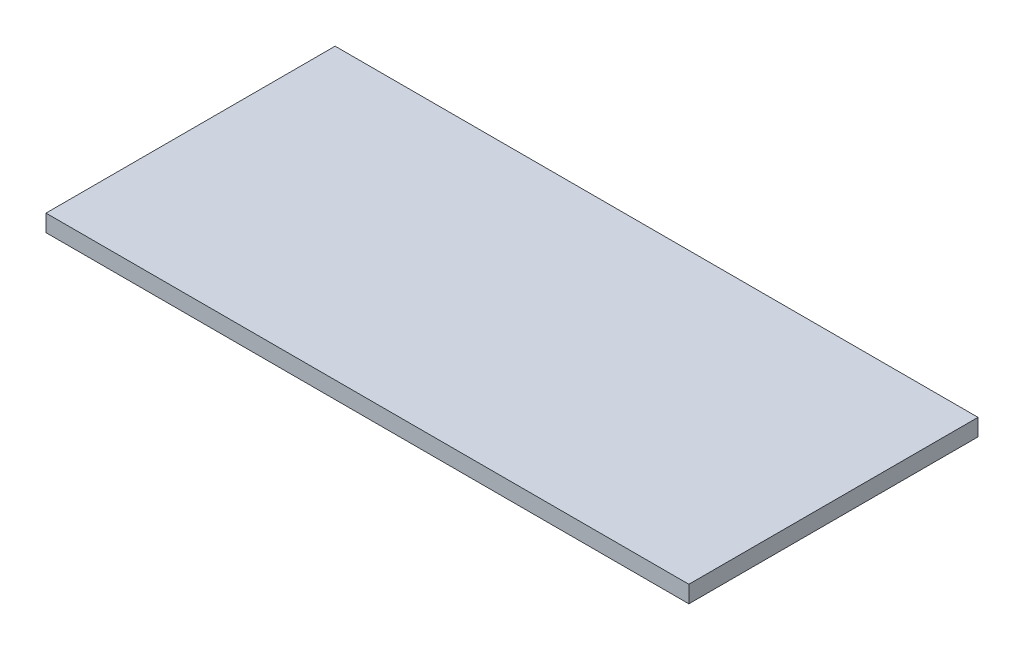
ISO-10303-21;
HEADER;
FILE_DESCRIPTION(('STEP AP214'),'2;1');
FILE_NAME('part.step','',(''),(''),'','','');
FILE_SCHEMA(('AUTOMOTIVE_DESIGN { 1 0 10303 214 1 1 1 1 }'));
ENDSEC;
DATA;
#1=APPLICATION_CONTEXT('core data for automotive mechanical design processes');
#2=APPLICATION_PROTOCOL_DEFINITION('international standard','automotive_design',2000,#1);
#3=PRODUCT_CONTEXT('',#1,'mechanical');
#4=PRODUCT('Part','Part','',(#3));
#5=PRODUCT_RELATED_PRODUCT_CATEGORY('part','',(#4));
#6=PRODUCT_DEFINITION_FORMATION('','',#4);
#7=PRODUCT_DEFINITION_CONTEXT('part definition',#1,'design');
#8=PRODUCT_DEFINITION('design','',#6,#7);
#9=PRODUCT_DEFINITION_SHAPE('','',#8);
#10=(LENGTH_UNIT() NAMED_UNIT(*) SI_UNIT(.MILLI.,.METRE.));
#11=(NAMED_UNIT(*) PLANE_ANGLE_UNIT() SI_UNIT($,.RADIAN.));
#12=(NAMED_UNIT(*) SI_UNIT($,.STERADIAN.) SOLID_ANGLE_UNIT());
#13=UNCERTAINTY_MEASURE_WITH_UNIT(LENGTH_MEASURE(1.E-05),#10,'distance_accuracy_value','');
#14=(GEOMETRIC_REPRESENTATION_CONTEXT(3) GLOBAL_UNCERTAINTY_ASSIGNED_CONTEXT((#13)) GLOBAL_UNIT_ASSIGNED_CONTEXT((#10,
#11,#12)) REPRESENTATION_CONTEXT('',''));
#15=CARTESIAN_POINT('',(0.,0.,0.));
#16=DIRECTION('',(0.,0.,1.));
#17=DIRECTION('',(1.,0.,0.));
#18=AXIS2_PLACEMENT_3D('',#15,#16,#17);
#19=CARTESIAN_POINT('',(0.,1.5875,0.));
#20=DIRECTION('',(1.,0.,0.));
#21=DIRECTION('',(0.,0.,-1.));
#22=AXIS2_PLACEMENT_3D('',#19,#20,#21);
#23=PLANE('',#22);
#24=DIRECTION('',(0.,0.,1.));
#25=VECTOR('',#24,1.);
#26=CARTESIAN_POINT('',(0.,0.,0.));
#27=LINE('',#26,#25);
#28=CARTESIAN_POINT('',(0.,0.,-27.051));
#29=VERTEX_POINT('',#28);
#30=CARTESIAN_POINT('',(0.,0.,0.));
#31=VERTEX_POINT('',#30);
#32=EDGE_CURVE('E96',#29,#31,#27,.T.);
#33=ORIENTED_EDGE('',*,*,#32,.T.);
#34=DIRECTION('',(0.,-1.,0.));
#35=VECTOR('',#34,1.);
#36=CARTESIAN_POINT('',(0.,1.5875,0.));
#37=LINE('',#36,#35);
#38=CARTESIAN_POINT('',(0.,1.5875,0.));
#39=VERTEX_POINT('',#38);
#40=EDGE_CURVE('E11',#39,#31,#37,.T.);
#41=ORIENTED_EDGE('',*,*,#40,.F.);
#42=DIRECTION('',(0.,0.,1.));
#43=VECTOR('',#42,1.);
#44=CARTESIAN_POINT('',(0.,1.5875,0.));
#45=LINE('',#44,#43);
#46=CARTESIAN_POINT('',(0.,1.5875,-27.051));
#47=VERTEX_POINT('',#46);
#48=EDGE_CURVE('E84',#47,#39,#45,.T.);
#49=ORIENTED_EDGE('',*,*,#48,.F.);
#50=DIRECTION('',(0.,-1.,0.));
#51=VECTOR('',#50,1.);
#52=CARTESIAN_POINT('',(0.,1.5875,-27.051));
#53=LINE('',#52,#51);
#54=EDGE_CURVE('E92',#47,#29,#53,.T.);
#55=ORIENTED_EDGE('',*,*,#54,.T.);
#56=EDGE_LOOP('',(#33,#41,#49,#55));
#57=FACE_BOUND('',#56,.T.);
#58=ADVANCED_FACE('F33',(#57),#23,.F.);
#59=CARTESIAN_POINT('',(0.,1.5875,0.));
#60=DIRECTION('',(0.,0.,-1.));
#61=DIRECTION('',(-1.,0.,0.));
#62=AXIS2_PLACEMENT_3D('',#59,#60,#61);
#63=PLANE('',#62);
#64=DIRECTION('',(1.,0.,0.));
#65=VECTOR('',#64,1.);
#66=CARTESIAN_POINT('',(0.,0.,0.));
#67=LINE('',#66,#65);
#68=CARTESIAN_POINT('',(60.1472,0.,0.));
#69=VERTEX_POINT('',#68);
#70=EDGE_CURVE('E88',#31,#69,#67,.T.);
#71=ORIENTED_EDGE('',*,*,#70,.T.);
#72=DIRECTION('',(0.,-1.,0.));
#73=VECTOR('',#72,1.);
#74=CARTESIAN_POINT('',(60.1472,1.5875,0.));
#75=LINE('',#74,#73);
#76=CARTESIAN_POINT('',(60.1472,1.5875,0.));
#77=VERTEX_POINT('',#76);
#78=EDGE_CURVE('E41',#77,#69,#75,.T.);
#79=ORIENTED_EDGE('',*,*,#78,.F.);
#80=DIRECTION('',(1.,0.,0.));
#81=VECTOR('',#80,1.);
#82=CARTESIAN_POINT('',(0.,1.5875,0.));
#83=LINE('',#82,#81);
#84=EDGE_CURVE('E79',#39,#77,#83,.T.);
#85=ORIENTED_EDGE('',*,*,#84,.F.);
#86=ORIENTED_EDGE('',*,*,#40,.T.);
#87=EDGE_LOOP('',(#71,#79,#85,#86));
#88=FACE_BOUND('',#87,.T.);
#89=ADVANCED_FACE('F87',(#88),#63,.F.);
#90=CARTESIAN_POINT('',(60.1472,1.5875,0.));
#91=DIRECTION('',(-1.,0.,0.));
#92=DIRECTION('',(0.,0.,1.));
#93=AXIS2_PLACEMENT_3D('',#90,#91,#92);
#94=PLANE('',#93);
#95=DIRECTION('',(0.,0.,-1.));
#96=VECTOR('',#95,1.);
#97=CARTESIAN_POINT('',(60.1472,0.,0.));
#98=LINE('',#97,#96);
#99=CARTESIAN_POINT('',(60.1472,0.,-27.051));
#100=VERTEX_POINT('',#99);
#101=EDGE_CURVE('E66',#69,#100,#98,.T.);
#102=ORIENTED_EDGE('',*,*,#101,.T.);
#103=DIRECTION('',(0.,-1.,0.));
#104=VECTOR('',#103,1.);
#105=CARTESIAN_POINT('',(60.1472,1.5875,-27.051));
#106=LINE('',#105,#104);
#107=CARTESIAN_POINT('',(60.1472,1.5875,-27.051));
#108=VERTEX_POINT('',#107);
#109=EDGE_CURVE('E89',#108,#100,#106,.T.);
#110=ORIENTED_EDGE('',*,*,#109,.F.);
#111=DIRECTION('',(0.,0.,-1.));
#112=VECTOR('',#111,1.);
#113=CARTESIAN_POINT('',(60.1472,1.5875,0.));
#114=LINE('',#113,#112);
#115=EDGE_CURVE('E82',#77,#108,#114,.T.);
#116=ORIENTED_EDGE('',*,*,#115,.F.);
#117=ORIENTED_EDGE('',*,*,#78,.T.);
#118=EDGE_LOOP('',(#102,#110,#116,#117));
#119=FACE_BOUND('',#118,.T.);
#120=ADVANCED_FACE('F90',(#119),#94,.F.);
#121=CARTESIAN_POINT('',(0.,1.5875,-27.051));
#122=DIRECTION('',(0.,0.,1.));
#123=DIRECTION('',(1.,0.,0.));
#124=AXIS2_PLACEMENT_3D('',#121,#122,#123);
#125=PLANE('',#124);
#126=DIRECTION('',(-1.,0.,0.));
#127=VECTOR('',#126,1.);
#128=CARTESIAN_POINT('',(0.,0.,-27.051));
#129=LINE('',#128,#127);
#130=EDGE_CURVE('E72',#100,#29,#129,.T.);
#131=ORIENTED_EDGE('',*,*,#130,.T.);
#132=ORIENTED_EDGE('',*,*,#54,.F.);
#133=DIRECTION('',(-1.,0.,0.));
#134=VECTOR('',#133,1.);
#135=CARTESIAN_POINT('',(0.,1.5875,-27.051));
#136=LINE('',#135,#134);
#137=EDGE_CURVE('E49',#108,#47,#136,.T.);
#138=ORIENTED_EDGE('',*,*,#137,.F.);
#139=ORIENTED_EDGE('',*,*,#109,.T.);
#140=EDGE_LOOP('',(#131,#132,#138,#139));
#141=FACE_BOUND('',#140,.T.);
#142=ADVANCED_FACE('F103',(#141),#125,.F.);
#143=CARTESIAN_POINT('',(0.,1.5875,0.));
#144=DIRECTION('',(0.,-1.,0.));
#145=DIRECTION('',(0.,0.,-1.));
#146=AXIS2_PLACEMENT_3D('',#143,#144,#145);
#147=PLANE('',#146);
#148=ORIENTED_EDGE('',*,*,#48,.T.);
#149=ORIENTED_EDGE('',*,*,#84,.T.);
#150=ORIENTED_EDGE('',*,*,#115,.T.);
#151=ORIENTED_EDGE('',*,*,#137,.T.);
#152=EDGE_LOOP('',(#148,#149,#150,#151));
#153=FACE_BOUND('',#152,.T.);
#154=ADVANCED_FACE('F80',(#153),#147,.F.);
#155=CARTESIAN_POINT('',(0.,0.,0.));
#156=DIRECTION('',(0.,-1.,0.));
#157=DIRECTION('',(0.,0.,-1.));
#158=AXIS2_PLACEMENT_3D('',#155,#156,#157);
#159=PLANE('',#158);
#160=ORIENTED_EDGE('',*,*,#32,.F.);
#161=ORIENTED_EDGE('',*,*,#130,.F.);
#162=ORIENTED_EDGE('',*,*,#101,.F.);
#163=ORIENTED_EDGE('',*,*,#70,.F.);
#164=EDGE_LOOP('',(#160,#161,#162,#163));
#165=FACE_BOUND('',#164,.T.);
#166=ADVANCED_FACE('F106',(#165),#159,.T.);
#167=CLOSED_SHELL('',(#58,#89,#120,#142,#154,#166));
#168=MANIFOLD_SOLID_BREP('B2',#167);
#169=ADVANCED_BREP_SHAPE_REPRESENTATION('',(#18,#168),#14);
#170=SHAPE_DEFINITION_REPRESENTATION(#9,#169);
ENDSEC;
END-ISO-10303-21;
